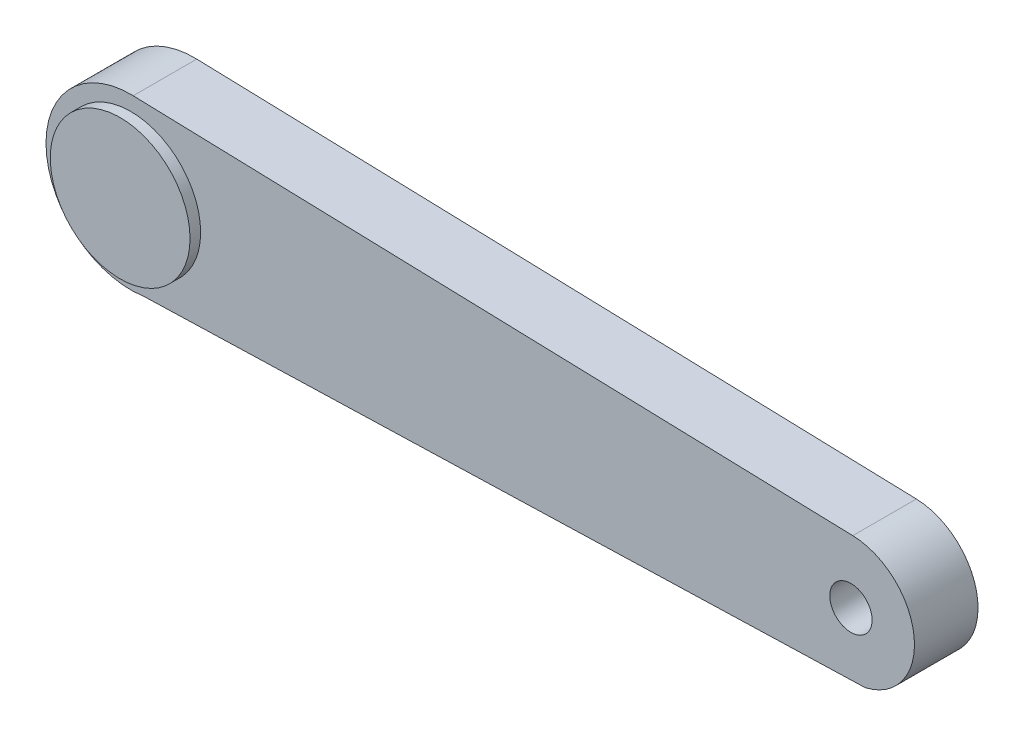
ISO-10303-21;
HEADER;
FILE_DESCRIPTION(('STEP AP214'),'2;1');
FILE_NAME('part.step','',(''),(''),'','','');
FILE_SCHEMA(('AUTOMOTIVE_DESIGN { 1 0 10303 214 1 1 1 1 }'));
ENDSEC;
DATA;
#1=APPLICATION_CONTEXT('core data for automotive mechanical design processes');
#2=APPLICATION_PROTOCOL_DEFINITION('international standard','automotive_design',2000,#1);
#3=PRODUCT_CONTEXT('',#1,'mechanical');
#4=PRODUCT('Part','Part','',(#3));
#5=PRODUCT_RELATED_PRODUCT_CATEGORY('part','',(#4));
#6=PRODUCT_DEFINITION_FORMATION('','',#4);
#7=PRODUCT_DEFINITION_CONTEXT('part definition',#1,'design');
#8=PRODUCT_DEFINITION('design','',#6,#7);
#9=PRODUCT_DEFINITION_SHAPE('','',#8);
#10=(LENGTH_UNIT() NAMED_UNIT(*) SI_UNIT(.MILLI.,.METRE.));
#11=(NAMED_UNIT(*) PLANE_ANGLE_UNIT() SI_UNIT($,.RADIAN.));
#12=(NAMED_UNIT(*) SI_UNIT($,.STERADIAN.) SOLID_ANGLE_UNIT());
#13=UNCERTAINTY_MEASURE_WITH_UNIT(LENGTH_MEASURE(1.E-05),#10,'distance_accuracy_value','');
#14=(GEOMETRIC_REPRESENTATION_CONTEXT(3) GLOBAL_UNCERTAINTY_ASSIGNED_CONTEXT((#13)) GLOBAL_UNIT_ASSIGNED_CONTEXT((#10,
#11,#12)) REPRESENTATION_CONTEXT('',''));
#15=CARTESIAN_POINT('',(0.,0.,0.));
#16=DIRECTION('',(0.,0.,1.));
#17=DIRECTION('',(1.,0.,0.));
#18=AXIS2_PLACEMENT_3D('',#15,#16,#17);
#19=CARTESIAN_POINT('',(0.522370495305952,-17.2766330249204,7.5));
#20=DIRECTION('',(-0.0302218542105337,0.999543215437971,0.));
#21=DIRECTION('',(-0.999543215437971,-0.0302218542105337,0.));
#22=AXIS2_PLACEMENT_3D('',#19,#20,#21);
#23=PLANE('',#22);
#24=DIRECTION('',(0.999543215437971,0.0302218542105337,0.));
#25=VECTOR('',#24,1.);
#26=CARTESIAN_POINT('',(0.522370495305952,-17.2766330249204,-7.5));
#27=LINE('',#26,#25);
#28=CARTESIAN_POINT('',(-81.9838543922029,-19.7712636336822,-7.5));
#29=VERTEX_POINT('',#28);
#30=CARTESIAN_POINT('',(88.350129521236,-14.6211022905574,-7.5));
#31=VERTEX_POINT('',#30);
#32=EDGE_CURVE('E115',#29,#31,#27,.T.);
#33=ORIENTED_EDGE('',*,*,#32,.T.);
#34=DIRECTION('',(0.,0.,-1.));
#35=VECTOR('',#34,1.);
#36=CARTESIAN_POINT('',(88.350129521236,-14.6211022905574,7.5));
#37=LINE('',#36,#35);
#38=CARTESIAN_POINT('',(88.350129521236,-14.6211022905574,7.5));
#39=VERTEX_POINT('',#38);
#40=EDGE_CURVE('E54',#39,#31,#37,.T.);
#41=ORIENTED_EDGE('',*,*,#40,.F.);
#42=DIRECTION('',(0.999543215437971,0.0302218542105337,0.));
#43=VECTOR('',#42,1.);
#44=CARTESIAN_POINT('',(0.522370495305952,-17.2766330249204,7.5));
#45=LINE('',#44,#43);
#46=CARTESIAN_POINT('',(-81.9838543922029,-19.7712636336822,7.5));
#47=VERTEX_POINT('',#46);
#48=EDGE_CURVE('E94',#47,#39,#45,.T.);
#49=ORIENTED_EDGE('',*,*,#48,.F.);
#50=DIRECTION('',(0.,0.,-1.));
#51=VECTOR('',#50,1.);
#52=CARTESIAN_POINT('',(-81.9838543922029,-19.7712636336822,7.5));
#53=LINE('',#52,#51);
#54=EDGE_CURVE('E111',#47,#29,#53,.T.);
#55=ORIENTED_EDGE('',*,*,#54,.T.);
#56=EDGE_LOOP('',(#33,#41,#49,#55));
#57=FACE_BOUND('',#56,.T.);
#58=ADVANCED_FACE('F45',(#57),#23,.F.);
#59=CARTESIAN_POINT('',(85.,0.,7.5));
#60=DIRECTION('',(0.,0.,-1.));
#61=DIRECTION('',(-1.,0.,0.));
#62=AXIS2_PLACEMENT_3D('',#59,#60,#61);
#63=CYLINDRICAL_SURFACE('',#62,15.);
#64=CARTESIAN_POINT('',(85.,0.,-7.5));
#65=DIRECTION('',(0.,0.,1.));
#66=DIRECTION('',(1.,0.,0.));
#67=AXIS2_PLACEMENT_3D('',#64,#65,#66);
#68=CIRCLE('',#67,15.);
#69=CARTESIAN_POINT('',(85.4411764705882,14.9935107070292,-7.5));
#70=VERTEX_POINT('',#69);
#71=EDGE_CURVE('E101',#31,#70,#68,.T.);
#72=ORIENTED_EDGE('',*,*,#71,.T.);
#73=DIRECTION('',(0.,0.,-1.));
#74=VECTOR('',#73,1.);
#75=CARTESIAN_POINT('',(85.4411764705882,14.9935107070292,7.5));
#76=LINE('',#75,#74);
#77=CARTESIAN_POINT('',(85.4411764705882,14.9935107070292,7.5));
#78=VERTEX_POINT('',#77);
#79=EDGE_CURVE('E99',#78,#70,#76,.T.);
#80=ORIENTED_EDGE('',*,*,#79,.F.);
#81=CARTESIAN_POINT('',(85.,0.,7.5));
#82=DIRECTION('',(0.,0.,1.));
#83=DIRECTION('',(1.,0.,0.));
#84=AXIS2_PLACEMENT_3D('',#81,#82,#83);
#85=CIRCLE('',#84,15.);
#86=EDGE_CURVE('E89',#39,#78,#85,.T.);
#87=ORIENTED_EDGE('',*,*,#86,.F.);
#88=ORIENTED_EDGE('',*,*,#40,.T.);
#89=EDGE_LOOP('',(#72,#80,#87,#88));
#90=FACE_BOUND('',#89,.T.);
#91=ADVANCED_FACE('F100',(#90),#63,.T.);
#92=CARTESIAN_POINT('',(0.514705882352942,17.4924291582007,7.5));
#93=DIRECTION('',(0.0294117647058824,0.999567380468613,0.));
#94=DIRECTION('',(-0.999567380468614,0.0294117647058824,0.));
#95=AXIS2_PLACEMENT_3D('',#92,#93,#94);
#96=PLANE('',#95);
#97=DIRECTION('',(0.999567380468613,-0.0294117647058824,0.));
#98=VECTOR('',#97,1.);
#99=CARTESIAN_POINT('',(0.514705882352942,17.4924291582007,-7.5));
#100=LINE('',#99,#98);
#101=CARTESIAN_POINT('',(-84.4117647058823,19.9913476093723,-7.5));
#102=VERTEX_POINT('',#101);
#103=EDGE_CURVE('E122',#102,#70,#100,.T.);
#104=ORIENTED_EDGE('',*,*,#103,.F.);
#105=DIRECTION('',(0.,0.,-1.));
#106=VECTOR('',#105,1.);
#107=CARTESIAN_POINT('',(-84.4117647058823,19.9913476093723,7.5));
#108=LINE('',#107,#106);
#109=CARTESIAN_POINT('',(-84.4117647058823,19.9913476093723,7.5));
#110=VERTEX_POINT('',#109);
#111=EDGE_CURVE('E78',#110,#102,#108,.T.);
#112=ORIENTED_EDGE('',*,*,#111,.F.);
#113=DIRECTION('',(0.999567380468613,-0.0294117647058824,0.));
#114=VECTOR('',#113,1.);
#115=CARTESIAN_POINT('',(0.514705882352942,17.4924291582007,7.5));
#116=LINE('',#115,#114);
#117=EDGE_CURVE('E92',#110,#78,#116,.T.);
#118=ORIENTED_EDGE('',*,*,#117,.T.);
#119=ORIENTED_EDGE('',*,*,#79,.T.);
#120=EDGE_LOOP('',(#104,#112,#118,#119));
#121=FACE_BOUND('',#120,.T.);
#122=ADVANCED_FACE('F107',(#121),#96,.T.);
#123=CARTESIAN_POINT('',(-85.,0.,7.5));
#124=DIRECTION('',(0.,0.,-1.));
#125=DIRECTION('',(-1.,0.,0.));
#126=AXIS2_PLACEMENT_3D('',#123,#124,#125);
#127=CYLINDRICAL_SURFACE('',#126,20.);
#128=CARTESIAN_POINT('',(-85.,0.,-7.5));
#129=DIRECTION('',(0.,0.,1.));
#130=DIRECTION('',(1.,0.,0.));
#131=AXIS2_PLACEMENT_3D('',#128,#129,#130);
#132=CIRCLE('',#131,20.);
#133=EDGE_CURVE('E81',#102,#29,#132,.T.);
#134=ORIENTED_EDGE('',*,*,#133,.T.);
#135=ORIENTED_EDGE('',*,*,#54,.F.);
#136=CARTESIAN_POINT('',(-85.,0.,7.5));
#137=DIRECTION('',(0.,0.,1.));
#138=DIRECTION('',(1.,0.,0.));
#139=AXIS2_PLACEMENT_3D('',#136,#137,#138);
#140=CIRCLE('',#139,20.);
#141=EDGE_CURVE('E62',#110,#47,#140,.T.);
#142=ORIENTED_EDGE('',*,*,#141,.F.);
#143=ORIENTED_EDGE('',*,*,#111,.T.);
#144=EDGE_LOOP('',(#134,#135,#142,#143));
#145=FACE_BOUND('',#144,.T.);
#146=ADVANCED_FACE('F173',(#145),#127,.T.);
#147=CARTESIAN_POINT('',(0.,0.,7.5));
#148=DIRECTION('',(0.,0.,1.));
#149=DIRECTION('',(1.,0.,0.));
#150=AXIS2_PLACEMENT_3D('',#147,#148,#149);
#151=PLANE('',#150);
#152=CARTESIAN_POINT('',(85.,0.,7.5));
#153=DIRECTION('',(0.,0.,1.));
#154=DIRECTION('',(1.,0.,0.));
#155=AXIS2_PLACEMENT_3D('',#152,#153,#154);
#156=CIRCLE('',#155,5.);
#157=CARTESIAN_POINT('',(90.,0.,7.5));
#158=VERTEX_POINT('',#157);
#159=EDGE_CURVE('E145',#158,#158,#156,.T.);
#160=ORIENTED_EDGE('',*,*,#159,.F.);
#161=EDGE_LOOP('',(#160));
#162=FACE_BOUND('',#161,.T.);
#163=CARTESIAN_POINT('',(-85.,0.,7.5));
#164=DIRECTION('',(0.,0.,1.));
#165=DIRECTION('',(1.,0.,0.));
#166=AXIS2_PLACEMENT_3D('',#163,#164,#165);
#167=CIRCLE('',#166,16.5);
#168=CARTESIAN_POINT('',(-68.5,0.,7.5));
#169=VERTEX_POINT('',#168);
#170=EDGE_CURVE('E119',#169,#169,#167,.F.);
#171=ORIENTED_EDGE('',*,*,#170,.T.);
#172=EDGE_LOOP('',(#171));
#173=FACE_BOUND('',#172,.T.);
#174=ORIENTED_EDGE('',*,*,#48,.T.);
#175=ORIENTED_EDGE('',*,*,#86,.T.);
#176=ORIENTED_EDGE('',*,*,#117,.F.);
#177=ORIENTED_EDGE('',*,*,#141,.T.);
#178=EDGE_LOOP('',(#174,#175,#176,#177));
#179=FACE_BOUND('',#178,.T.);
#180=ADVANCED_FACE('F90',(#162,#173,#179),#151,.T.);
#181=CARTESIAN_POINT('',(0.,0.,-7.5));
#182=DIRECTION('',(0.,0.,1.));
#183=DIRECTION('',(1.,0.,0.));
#184=AXIS2_PLACEMENT_3D('',#181,#182,#183);
#185=PLANE('',#184);
#186=CARTESIAN_POINT('',(-85.,0.,-7.5));
#187=DIRECTION('',(0.,0.,1.));
#188=DIRECTION('',(1.,0.,0.));
#189=AXIS2_PLACEMENT_3D('',#186,#187,#188);
#190=CIRCLE('',#189,5.);
#191=CARTESIAN_POINT('',(-80.,0.,-7.5));
#192=VERTEX_POINT('',#191);
#193=EDGE_CURVE('E11',#192,#192,#190,.F.);
#194=ORIENTED_EDGE('',*,*,#193,.F.);
#195=EDGE_LOOP('',(#194));
#196=FACE_BOUND('',#195,.T.);
#197=ORIENTED_EDGE('',*,*,#32,.F.);
#198=ORIENTED_EDGE('',*,*,#133,.F.);
#199=ORIENTED_EDGE('',*,*,#103,.T.);
#200=ORIENTED_EDGE('',*,*,#71,.F.);
#201=EDGE_LOOP('',(#197,#198,#199,#200));
#202=FACE_BOUND('',#201,.T.);
#203=ADVANCED_FACE('F166',(#196,#202),#185,.F.);
#204=CARTESIAN_POINT('',(-85.,0.,10.));
#205=DIRECTION('',(0.,0.,-1.));
#206=DIRECTION('',(-1.,0.,0.));
#207=AXIS2_PLACEMENT_3D('',#204,#205,#206);
#208=CYLINDRICAL_SURFACE('',#207,16.5);
#209=ORIENTED_EDGE('',*,*,#170,.F.);
#210=EDGE_LOOP('',(#209));
#211=FACE_BOUND('',#210,.T.);
#212=CARTESIAN_POINT('',(-85.,0.,10.));
#213=DIRECTION('',(0.,0.,1.));
#214=DIRECTION('',(1.,0.,0.));
#215=AXIS2_PLACEMENT_3D('',#212,#213,#214);
#216=CIRCLE('',#215,16.5);
#217=CARTESIAN_POINT('',(-68.5,0.,10.));
#218=VERTEX_POINT('',#217);
#219=EDGE_CURVE('E134',#218,#218,#216,.T.);
#220=ORIENTED_EDGE('',*,*,#219,.F.);
#221=EDGE_LOOP('',(#220));
#222=FACE_BOUND('',#221,.T.);
#223=ADVANCED_FACE('F169',(#211,#222),#208,.T.);
#224=CARTESIAN_POINT('',(-85.,0.,10.));
#225=DIRECTION('',(0.,0.,1.));
#226=DIRECTION('',(1.,0.,0.));
#227=AXIS2_PLACEMENT_3D('',#224,#225,#226);
#228=PLANE('',#227);
#229=ORIENTED_EDGE('',*,*,#219,.T.);
#230=EDGE_LOOP('',(#229));
#231=FACE_BOUND('',#230,.T.);
#232=ADVANCED_FACE('F209',(#231),#228,.T.);
#233=CARTESIAN_POINT('',(85.,0.,-2.5));
#234=DIRECTION('',(0.,0.,1.));
#235=DIRECTION('',(1.,0.,0.));
#236=AXIS2_PLACEMENT_3D('',#233,#234,#235);
#237=CYLINDRICAL_SURFACE('',#236,5.);
#238=CARTESIAN_POINT('',(85.,0.,-2.5));
#239=DIRECTION('',(0.,0.,1.));
#240=DIRECTION('',(1.,0.,0.));
#241=AXIS2_PLACEMENT_3D('',#238,#239,#240);
#242=CIRCLE('',#241,5.);
#243=CARTESIAN_POINT('',(90.,0.,-2.5));
#244=VERTEX_POINT('',#243);
#245=EDGE_CURVE('E139',#244,#244,#242,.T.);
#246=ORIENTED_EDGE('',*,*,#245,.F.);
#247=EDGE_LOOP('',(#246));
#248=FACE_BOUND('',#247,.T.);
#249=ORIENTED_EDGE('',*,*,#159,.T.);
#250=EDGE_LOOP('',(#249));
#251=FACE_BOUND('',#250,.T.);
#252=ADVANCED_FACE('F221',(#248,#251),#237,.F.);
#253=CARTESIAN_POINT('',(85.,0.,-2.5));
#254=DIRECTION('',(0.,0.,1.));
#255=DIRECTION('',(1.,0.,0.));
#256=AXIS2_PLACEMENT_3D('',#253,#254,#255);
#257=PLANE('',#256);
#258=ORIENTED_EDGE('',*,*,#245,.T.);
#259=EDGE_LOOP('',(#258));
#260=FACE_BOUND('',#259,.T.);
#261=ADVANCED_FACE('F162',(#260),#257,.T.);
#262=CARTESIAN_POINT('',(-85.,0.,-17.5));
#263=DIRECTION('',(0.,0.,1.));
#264=DIRECTION('',(1.,0.,0.));
#265=AXIS2_PLACEMENT_3D('',#262,#263,#264);
#266=CYLINDRICAL_SURFACE('',#265,5.);
#267=CARTESIAN_POINT('',(-85.,0.,-17.5));
#268=DIRECTION('',(0.,0.,-1.));
#269=DIRECTION('',(-1.,0.,0.));
#270=AXIS2_PLACEMENT_3D('',#267,#268,#269);
#271=CIRCLE('',#270,5.);
#272=CARTESIAN_POINT('',(-90.,0.,-17.5));
#273=VERTEX_POINT('',#272);
#274=EDGE_CURVE('E151',#273,#273,#271,.T.);
#275=ORIENTED_EDGE('',*,*,#274,.F.);
#276=EDGE_LOOP('',(#275));
#277=FACE_BOUND('',#276,.T.);
#278=ORIENTED_EDGE('',*,*,#193,.T.);
#279=EDGE_LOOP('',(#278));
#280=FACE_BOUND('',#279,.T.);
#281=ADVANCED_FACE('F159',(#277,#280),#266,.T.);
#282=CARTESIAN_POINT('',(-85.,0.,-17.5));
#283=DIRECTION('',(0.,0.,-1.));
#284=DIRECTION('',(-1.,0.,0.));
#285=AXIS2_PLACEMENT_3D('',#282,#283,#284);
#286=PLANE('',#285);
#287=ORIENTED_EDGE('',*,*,#274,.T.);
#288=EDGE_LOOP('',(#287));
#289=FACE_BOUND('',#288,.T.);
#290=ADVANCED_FACE('F157',(#289),#286,.T.);
#291=CLOSED_SHELL('',(#58,#91,#122,#146,#180,#203,#223,#232,#252,#261,#281,#290));
#292=MANIFOLD_SOLID_BREP('B2',#291);
#293=ADVANCED_BREP_SHAPE_REPRESENTATION('',(#18,#292),#14);
#294=SHAPE_DEFINITION_REPRESENTATION(#9,#293);
ENDSEC;
END-ISO-10303-21;
